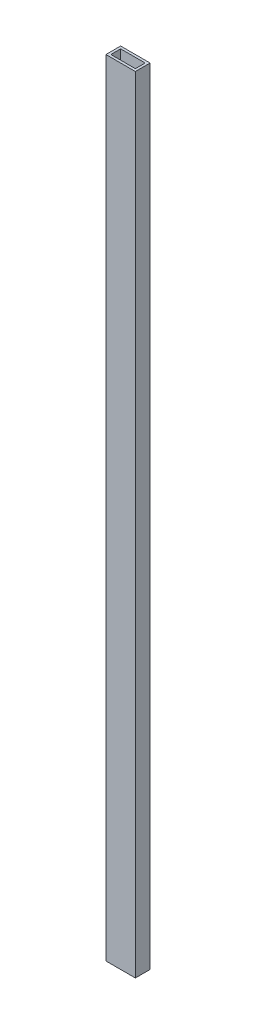
ISO-10303-21;
HEADER;
FILE_DESCRIPTION(('STEP AP214'),'2;1');
FILE_NAME('part.step','',(''),(''),'','','');
FILE_SCHEMA(('AUTOMOTIVE_DESIGN { 1 0 10303 214 1 1 1 1 }'));
ENDSEC;
DATA;
#1=APPLICATION_CONTEXT('core data for automotive mechanical design processes');
#2=APPLICATION_PROTOCOL_DEFINITION('international standard','automotive_design',2000,#1);
#3=PRODUCT_CONTEXT('',#1,'mechanical');
#4=PRODUCT('Part','Part','',(#3));
#5=PRODUCT_RELATED_PRODUCT_CATEGORY('part','',(#4));
#6=PRODUCT_DEFINITION_FORMATION('','',#4);
#7=PRODUCT_DEFINITION_CONTEXT('part definition',#1,'design');
#8=PRODUCT_DEFINITION('design','',#6,#7);
#9=PRODUCT_DEFINITION_SHAPE('','',#8);
#10=(LENGTH_UNIT() NAMED_UNIT(*) SI_UNIT(.MILLI.,.METRE.));
#11=(NAMED_UNIT(*) PLANE_ANGLE_UNIT() SI_UNIT($,.RADIAN.));
#12=(NAMED_UNIT(*) SI_UNIT($,.STERADIAN.) SOLID_ANGLE_UNIT());
#13=UNCERTAINTY_MEASURE_WITH_UNIT(LENGTH_MEASURE(1.E-05),#10,'distance_accuracy_value','');
#14=(GEOMETRIC_REPRESENTATION_CONTEXT(3) GLOBAL_UNCERTAINTY_ASSIGNED_CONTEXT((#13)) GLOBAL_UNIT_ASSIGNED_CONTEXT((#10,
#11,#12)) REPRESENTATION_CONTEXT('',''));
#15=CARTESIAN_POINT('',(0.,0.,0.));
#16=DIRECTION('',(0.,0.,1.));
#17=DIRECTION('',(1.,0.,0.));
#18=AXIS2_PLACEMENT_3D('',#15,#16,#17);
#19=CARTESIAN_POINT('',(0.,1016.,0.));
#20=DIRECTION('',(0.,-1.,0.));
#21=DIRECTION('',(0.,0.,-1.));
#22=AXIS2_PLACEMENT_3D('',#19,#20,#21);
#23=PLANE('',#22);
#24=DIRECTION('',(0.,0.,1.));
#25=VECTOR('',#24,1.);
#26=CARTESIAN_POINT('',(0.,1016.,0.));
#27=LINE('',#26,#25);
#28=CARTESIAN_POINT('',(0.,1016.,-19.05));
#29=VERTEX_POINT('',#28);
#30=CARTESIAN_POINT('',(0.,1016.,0.));
#31=VERTEX_POINT('',#30);
#32=EDGE_CURVE('E148',#29,#31,#27,.T.);
#33=ORIENTED_EDGE('',*,*,#32,.T.);
#34=DIRECTION('',(1.,0.,0.));
#35=VECTOR('',#34,1.);
#36=CARTESIAN_POINT('',(0.,1016.,0.));
#37=LINE('',#36,#35);
#38=CARTESIAN_POINT('',(38.1,1016.,0.));
#39=VERTEX_POINT('',#38);
#40=EDGE_CURVE('E151',#31,#39,#37,.T.);
#41=ORIENTED_EDGE('',*,*,#40,.T.);
#42=DIRECTION('',(0.,0.,-1.));
#43=VECTOR('',#42,1.);
#44=CARTESIAN_POINT('',(38.1,1016.,0.));
#45=LINE('',#44,#43);
#46=CARTESIAN_POINT('',(38.1,1016.,-19.05));
#47=VERTEX_POINT('',#46);
#48=EDGE_CURVE('E154',#39,#47,#45,.T.);
#49=ORIENTED_EDGE('',*,*,#48,.T.);
#50=DIRECTION('',(-1.,0.,0.));
#51=VECTOR('',#50,1.);
#52=CARTESIAN_POINT('',(0.,1016.,-19.05));
#53=LINE('',#52,#51);
#54=EDGE_CURVE('E156',#47,#29,#53,.T.);
#55=ORIENTED_EDGE('',*,*,#54,.T.);
#56=EDGE_LOOP('',(#33,#41,#49,#55));
#57=FACE_BOUND('',#56,.T.);
#58=DIRECTION('',(0.,0.,1.));
#59=VECTOR('',#58,1.);
#60=CARTESIAN_POINT('',(3.175,1016.,-3.175));
#61=LINE('',#60,#59);
#62=CARTESIAN_POINT('',(3.175,1016.,-15.875));
#63=VERTEX_POINT('',#62);
#64=CARTESIAN_POINT('',(3.175,1016.,-3.175));
#65=VERTEX_POINT('',#64);
#66=EDGE_CURVE('E107',#63,#65,#61,.T.);
#67=ORIENTED_EDGE('',*,*,#66,.F.);
#68=DIRECTION('',(-1.,0.,0.));
#69=VECTOR('',#68,1.);
#70=CARTESIAN_POINT('',(3.175,1016.,-15.875));
#71=LINE('',#70,#69);
#72=CARTESIAN_POINT('',(34.925,1016.,-15.875));
#73=VERTEX_POINT('',#72);
#74=EDGE_CURVE('E130',#73,#63,#71,.T.);
#75=ORIENTED_EDGE('',*,*,#74,.F.);
#76=DIRECTION('',(0.,0.,-1.));
#77=VECTOR('',#76,1.);
#78=CARTESIAN_POINT('',(34.925,1016.,-3.175));
#79=LINE('',#78,#77);
#80=CARTESIAN_POINT('',(34.925,1016.,-3.175));
#81=VERTEX_POINT('',#80);
#82=EDGE_CURVE('E128',#81,#73,#79,.T.);
#83=ORIENTED_EDGE('',*,*,#82,.F.);
#84=DIRECTION('',(1.,0.,0.));
#85=VECTOR('',#84,1.);
#86=CARTESIAN_POINT('',(3.175,1016.,-3.175));
#87=LINE('',#86,#85);
#88=EDGE_CURVE('E115',#65,#81,#87,.T.);
#89=ORIENTED_EDGE('',*,*,#88,.F.);
#90=EDGE_LOOP('',(#67,#75,#83,#89));
#91=FACE_BOUND('',#90,.T.);
#92=ADVANCED_FACE('F37',(#57,#91),#23,.F.);
#93=CARTESIAN_POINT('',(0.,0.,0.));
#94=DIRECTION('',(0.,-1.,0.));
#95=DIRECTION('',(0.,0.,-1.));
#96=AXIS2_PLACEMENT_3D('',#93,#94,#95);
#97=PLANE('',#96);
#98=DIRECTION('',(0.,0.,1.));
#99=VECTOR('',#98,1.);
#100=CARTESIAN_POINT('',(0.,0.,0.));
#101=LINE('',#100,#99);
#102=CARTESIAN_POINT('',(0.,0.,-19.05));
#103=VERTEX_POINT('',#102);
#104=CARTESIAN_POINT('',(0.,0.,0.));
#105=VERTEX_POINT('',#104);
#106=EDGE_CURVE('E124',#103,#105,#101,.T.);
#107=ORIENTED_EDGE('',*,*,#106,.F.);
#108=DIRECTION('',(-1.,0.,0.));
#109=VECTOR('',#108,1.);
#110=CARTESIAN_POINT('',(0.,0.,-19.05));
#111=LINE('',#110,#109);
#112=CARTESIAN_POINT('',(38.1,0.,-19.05));
#113=VERTEX_POINT('',#112);
#114=EDGE_CURVE('E152',#113,#103,#111,.T.);
#115=ORIENTED_EDGE('',*,*,#114,.F.);
#116=DIRECTION('',(0.,0.,-1.));
#117=VECTOR('',#116,1.);
#118=CARTESIAN_POINT('',(38.1,0.,0.));
#119=LINE('',#118,#117);
#120=CARTESIAN_POINT('',(38.1,0.,0.));
#121=VERTEX_POINT('',#120);
#122=EDGE_CURVE('E165',#121,#113,#119,.T.);
#123=ORIENTED_EDGE('',*,*,#122,.F.);
#124=DIRECTION('',(1.,0.,0.));
#125=VECTOR('',#124,1.);
#126=CARTESIAN_POINT('',(0.,0.,0.));
#127=LINE('',#126,#125);
#128=EDGE_CURVE('E162',#105,#121,#127,.T.);
#129=ORIENTED_EDGE('',*,*,#128,.F.);
#130=EDGE_LOOP('',(#107,#115,#123,#129));
#131=FACE_BOUND('',#130,.T.);
#132=DIRECTION('',(-1.,0.,0.));
#133=VECTOR('',#132,1.);
#134=CARTESIAN_POINT('',(3.175,0.,-15.875));
#135=LINE('',#134,#133);
#136=CARTESIAN_POINT('',(34.925,0.,-15.875));
#137=VERTEX_POINT('',#136);
#138=CARTESIAN_POINT('',(3.175,0.,-15.875));
#139=VERTEX_POINT('',#138);
#140=EDGE_CURVE('E116',#137,#139,#135,.T.);
#141=ORIENTED_EDGE('',*,*,#140,.T.);
#142=DIRECTION('',(0.,0.,1.));
#143=VECTOR('',#142,1.);
#144=CARTESIAN_POINT('',(3.175,0.,-3.175));
#145=LINE('',#144,#143);
#146=CARTESIAN_POINT('',(3.175,0.,-3.175));
#147=VERTEX_POINT('',#146);
#148=EDGE_CURVE('E64',#139,#147,#145,.T.);
#149=ORIENTED_EDGE('',*,*,#148,.T.);
#150=DIRECTION('',(1.,0.,0.));
#151=VECTOR('',#150,1.);
#152=CARTESIAN_POINT('',(3.175,0.,-3.175));
#153=LINE('',#152,#151);
#154=CARTESIAN_POINT('',(34.925,0.,-3.175));
#155=VERTEX_POINT('',#154);
#156=EDGE_CURVE('E122',#147,#155,#153,.T.);
#157=ORIENTED_EDGE('',*,*,#156,.T.);
#158=DIRECTION('',(0.,0.,-1.));
#159=VECTOR('',#158,1.);
#160=CARTESIAN_POINT('',(34.925,0.,-3.175));
#161=LINE('',#160,#159);
#162=EDGE_CURVE('E138',#155,#137,#161,.T.);
#163=ORIENTED_EDGE('',*,*,#162,.T.);
#164=EDGE_LOOP('',(#141,#149,#157,#163));
#165=FACE_BOUND('',#164,.T.);
#166=ADVANCED_FACE('F185',(#131,#165),#97,.T.);
#167=CARTESIAN_POINT('',(0.,1016.,0.));
#168=DIRECTION('',(1.,0.,0.));
#169=DIRECTION('',(0.,0.,-1.));
#170=AXIS2_PLACEMENT_3D('',#167,#168,#169);
#171=PLANE('',#170);
#172=ORIENTED_EDGE('',*,*,#106,.T.);
#173=DIRECTION('',(0.,-1.,0.));
#174=VECTOR('',#173,1.);
#175=CARTESIAN_POINT('',(0.,1016.,0.));
#176=LINE('',#175,#174);
#177=EDGE_CURVE('E11',#31,#105,#176,.T.);
#178=ORIENTED_EDGE('',*,*,#177,.F.);
#179=ORIENTED_EDGE('',*,*,#32,.F.);
#180=DIRECTION('',(0.,-1.,0.));
#181=VECTOR('',#180,1.);
#182=CARTESIAN_POINT('',(0.,1016.,-19.05));
#183=LINE('',#182,#181);
#184=EDGE_CURVE('E158',#29,#103,#183,.T.);
#185=ORIENTED_EDGE('',*,*,#184,.T.);
#186=EDGE_LOOP('',(#172,#178,#179,#185));
#187=FACE_BOUND('',#186,.T.);
#188=ADVANCED_FACE('F39',(#187),#171,.F.);
#189=CARTESIAN_POINT('',(0.,1016.,0.));
#190=DIRECTION('',(0.,0.,-1.));
#191=DIRECTION('',(-1.,0.,0.));
#192=AXIS2_PLACEMENT_3D('',#189,#190,#191);
#193=PLANE('',#192);
#194=ORIENTED_EDGE('',*,*,#128,.T.);
#195=DIRECTION('',(0.,-1.,0.));
#196=VECTOR('',#195,1.);
#197=CARTESIAN_POINT('',(38.1,1016.,0.));
#198=LINE('',#197,#196);
#199=EDGE_CURVE('E46',#39,#121,#198,.T.);
#200=ORIENTED_EDGE('',*,*,#199,.F.);
#201=ORIENTED_EDGE('',*,*,#40,.F.);
#202=ORIENTED_EDGE('',*,*,#177,.T.);
#203=EDGE_LOOP('',(#194,#200,#201,#202));
#204=FACE_BOUND('',#203,.T.);
#205=ADVANCED_FACE('F195',(#204),#193,.F.);
#206=CARTESIAN_POINT('',(38.1,1016.,0.));
#207=DIRECTION('',(-1.,0.,0.));
#208=DIRECTION('',(0.,0.,1.));
#209=AXIS2_PLACEMENT_3D('',#206,#207,#208);
#210=PLANE('',#209);
#211=ORIENTED_EDGE('',*,*,#122,.T.);
#212=DIRECTION('',(0.,-1.,0.));
#213=VECTOR('',#212,1.);
#214=CARTESIAN_POINT('',(38.1,1016.,-19.05));
#215=LINE('',#214,#213);
#216=EDGE_CURVE('E172',#47,#113,#215,.T.);
#217=ORIENTED_EDGE('',*,*,#216,.F.);
#218=ORIENTED_EDGE('',*,*,#48,.F.);
#219=ORIENTED_EDGE('',*,*,#199,.T.);
#220=EDGE_LOOP('',(#211,#217,#218,#219));
#221=FACE_BOUND('',#220,.T.);
#222=ADVANCED_FACE('F179',(#221),#210,.F.);
#223=CARTESIAN_POINT('',(0.,1016.,-19.05));
#224=DIRECTION('',(0.,0.,1.));
#225=DIRECTION('',(1.,0.,0.));
#226=AXIS2_PLACEMENT_3D('',#223,#224,#225);
#227=PLANE('',#226);
#228=ORIENTED_EDGE('',*,*,#114,.T.);
#229=ORIENTED_EDGE('',*,*,#184,.F.);
#230=ORIENTED_EDGE('',*,*,#54,.F.);
#231=ORIENTED_EDGE('',*,*,#216,.T.);
#232=EDGE_LOOP('',(#228,#229,#230,#231));
#233=FACE_BOUND('',#232,.T.);
#234=ADVANCED_FACE('F189',(#233),#227,.F.);
#235=CARTESIAN_POINT('',(3.175,1016.,-3.175));
#236=DIRECTION('',(1.,0.,0.));
#237=DIRECTION('',(0.,0.,-1.));
#238=AXIS2_PLACEMENT_3D('',#235,#236,#237);
#239=PLANE('',#238);
#240=ORIENTED_EDGE('',*,*,#148,.F.);
#241=DIRECTION('',(0.,-1.,0.));
#242=VECTOR('',#241,1.);
#243=CARTESIAN_POINT('',(3.175,1016.,-15.875));
#244=LINE('',#243,#242);
#245=EDGE_CURVE('E111',#63,#139,#244,.T.);
#246=ORIENTED_EDGE('',*,*,#245,.F.);
#247=ORIENTED_EDGE('',*,*,#66,.T.);
#248=DIRECTION('',(0.,-1.,0.));
#249=VECTOR('',#248,1.);
#250=CARTESIAN_POINT('',(3.175,1016.,-3.175));
#251=LINE('',#250,#249);
#252=EDGE_CURVE('E110',#65,#147,#251,.T.);
#253=ORIENTED_EDGE('',*,*,#252,.T.);
#254=EDGE_LOOP('',(#240,#246,#247,#253));
#255=FACE_BOUND('',#254,.T.);
#256=ADVANCED_FACE('F109',(#255),#239,.T.);
#257=CARTESIAN_POINT('',(3.175,1016.,-3.175));
#258=DIRECTION('',(0.,0.,-1.));
#259=DIRECTION('',(-1.,0.,0.));
#260=AXIS2_PLACEMENT_3D('',#257,#258,#259);
#261=PLANE('',#260);
#262=ORIENTED_EDGE('',*,*,#156,.F.);
#263=ORIENTED_EDGE('',*,*,#252,.F.);
#264=ORIENTED_EDGE('',*,*,#88,.T.);
#265=DIRECTION('',(0.,-1.,0.));
#266=VECTOR('',#265,1.);
#267=CARTESIAN_POINT('',(34.925,1016.,-3.175));
#268=LINE('',#267,#266);
#269=EDGE_CURVE('E125',#81,#155,#268,.T.);
#270=ORIENTED_EDGE('',*,*,#269,.T.);
#271=EDGE_LOOP('',(#262,#263,#264,#270));
#272=FACE_BOUND('',#271,.T.);
#273=ADVANCED_FACE('F119',(#272),#261,.T.);
#274=CARTESIAN_POINT('',(34.925,1016.,-3.175));
#275=DIRECTION('',(-1.,0.,0.));
#276=DIRECTION('',(0.,0.,1.));
#277=AXIS2_PLACEMENT_3D('',#274,#275,#276);
#278=PLANE('',#277);
#279=ORIENTED_EDGE('',*,*,#162,.F.);
#280=ORIENTED_EDGE('',*,*,#269,.F.);
#281=ORIENTED_EDGE('',*,*,#82,.T.);
#282=DIRECTION('',(0.,-1.,0.));
#283=VECTOR('',#282,1.);
#284=CARTESIAN_POINT('',(34.925,1016.,-15.875));
#285=LINE('',#284,#283);
#286=EDGE_CURVE('E53',#73,#137,#285,.T.);
#287=ORIENTED_EDGE('',*,*,#286,.T.);
#288=EDGE_LOOP('',(#279,#280,#281,#287));
#289=FACE_BOUND('',#288,.T.);
#290=ADVANCED_FACE('F218',(#289),#278,.T.);
#291=CARTESIAN_POINT('',(3.175,1016.,-15.875));
#292=DIRECTION('',(0.,0.,1.));
#293=DIRECTION('',(1.,0.,0.));
#294=AXIS2_PLACEMENT_3D('',#291,#292,#293);
#295=PLANE('',#294);
#296=ORIENTED_EDGE('',*,*,#140,.F.);
#297=ORIENTED_EDGE('',*,*,#286,.F.);
#298=ORIENTED_EDGE('',*,*,#74,.T.);
#299=ORIENTED_EDGE('',*,*,#245,.T.);
#300=EDGE_LOOP('',(#296,#297,#298,#299));
#301=FACE_BOUND('',#300,.T.);
#302=ADVANCED_FACE('F222',(#301),#295,.T.);
#303=CLOSED_SHELL('',(#92,#166,#188,#205,#222,#234,#256,#273,#290,#302));
#304=MANIFOLD_SOLID_BREP('B2',#303);
#305=ADVANCED_BREP_SHAPE_REPRESENTATION('',(#18,#304),#14);
#306=SHAPE_DEFINITION_REPRESENTATION(#9,#305);
ENDSEC;
END-ISO-10303-21;
